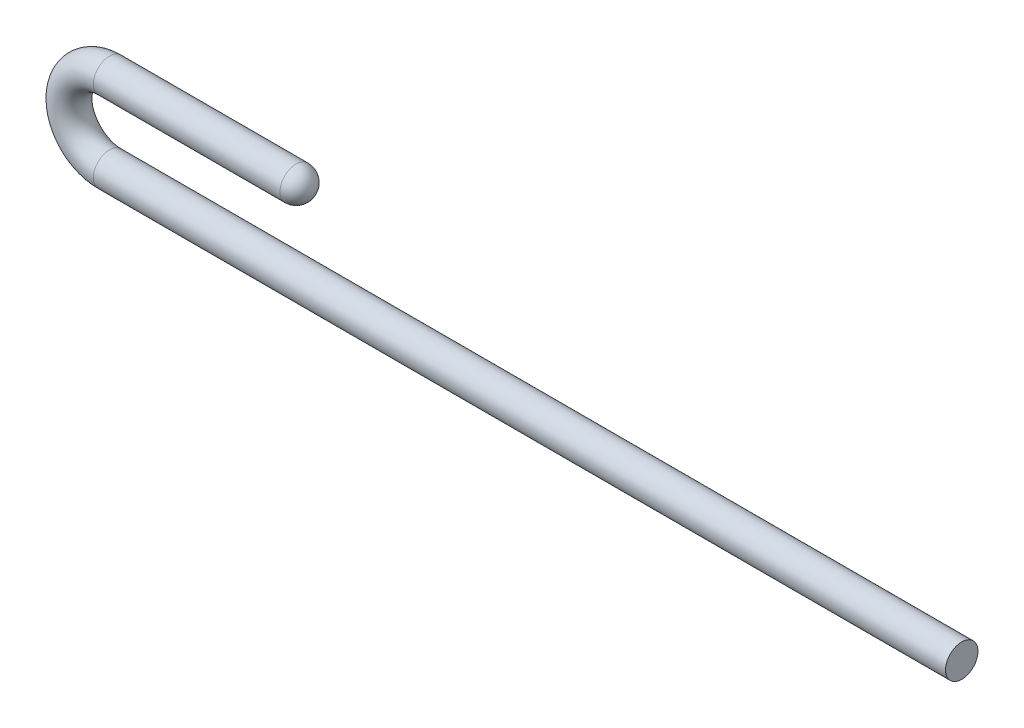
ISO-10303-21;
HEADER;
FILE_DESCRIPTION(('STEP AP214'),'2;1');
FILE_NAME('part.step','',(''),(''),'','','');
FILE_SCHEMA(('AUTOMOTIVE_DESIGN { 1 0 10303 214 1 1 1 1 }'));
ENDSEC;
DATA;
#1=APPLICATION_CONTEXT('core data for automotive mechanical design processes');
#2=APPLICATION_PROTOCOL_DEFINITION('international standard','automotive_design',2000,#1);
#3=PRODUCT_CONTEXT('',#1,'mechanical');
#4=PRODUCT('Part','Part','',(#3));
#5=PRODUCT_RELATED_PRODUCT_CATEGORY('part','',(#4));
#6=PRODUCT_DEFINITION_FORMATION('','',#4);
#7=PRODUCT_DEFINITION_CONTEXT('part definition',#1,'design');
#8=PRODUCT_DEFINITION('design','',#6,#7);
#9=PRODUCT_DEFINITION_SHAPE('','',#8);
#10=(LENGTH_UNIT() NAMED_UNIT(*) SI_UNIT(.MILLI.,.METRE.));
#11=(NAMED_UNIT(*) PLANE_ANGLE_UNIT() SI_UNIT($,.RADIAN.));
#12=(NAMED_UNIT(*) SI_UNIT($,.STERADIAN.) SOLID_ANGLE_UNIT());
#13=UNCERTAINTY_MEASURE_WITH_UNIT(LENGTH_MEASURE(1.E-05),#10,'distance_accuracy_value','');
#14=(GEOMETRIC_REPRESENTATION_CONTEXT(3) GLOBAL_UNCERTAINTY_ASSIGNED_CONTEXT((#13)) GLOBAL_UNIT_ASSIGNED_CONTEXT((#10,
#11,#12)) REPRESENTATION_CONTEXT('',''));
#15=CARTESIAN_POINT('',(0.,0.,0.));
#16=DIRECTION('',(0.,0.,1.));
#17=DIRECTION('',(1.,0.,0.));
#18=AXIS2_PLACEMENT_3D('',#15,#16,#17);
#19=CARTESIAN_POINT('',(-21.,2.,0.));
#20=DIRECTION('',(1.,0.,0.));
#21=DIRECTION('',(0.,1.,0.));
#22=AXIS2_PLACEMENT_3D('',#19,#20,#21);
#23=CYLINDRICAL_SURFACE('',#22,0.4);
#24=CARTESIAN_POINT('',(-16.4,2.,0.));
#25=DIRECTION('',(1.,0.,0.));
#26=DIRECTION('',(0.,1.,0.));
#27=AXIS2_PLACEMENT_3D('',#24,#25,#26);
#28=CIRCLE('',#27,0.4);
#29=CARTESIAN_POINT('',(-16.4,2.4,0.));
#30=VERTEX_POINT('',#29);
#31=EDGE_CURVE('E10',#30,#30,#28,.F.);
#32=ORIENTED_EDGE('',*,*,#31,.T.);
#33=EDGE_LOOP('',(#32));
#34=FACE_BOUND('',#33,.T.);
#35=CARTESIAN_POINT('',(-21.,2.,0.));
#36=DIRECTION('',(-1.,0.,0.));
#37=DIRECTION('',(0.,0.,-1.));
#38=AXIS2_PLACEMENT_3D('',#35,#36,#37);
#39=CIRCLE('',#38,0.4);
#40=CARTESIAN_POINT('',(-21.,2.4,0.));
#41=VERTEX_POINT('',#40);
#42=EDGE_CURVE('E35',#41,#41,#39,.T.);
#43=ORIENTED_EDGE('',*,*,#42,.F.);
#44=EDGE_LOOP('',(#43));
#45=FACE_BOUND('',#44,.T.);
#46=ADVANCED_FACE('F29',(#34,#45),#23,.T.);
#47=CARTESIAN_POINT('',(-21.,0.999999999999997,0.));
#48=DIRECTION('',(0.,0.,-1.));
#49=DIRECTION('',(-1.,0.,0.));
#50=AXIS2_PLACEMENT_3D('',#47,#48,#49);
#51=TOROIDAL_SURFACE('',#50,1.,0.4);
#52=CARTESIAN_POINT('',(-21.,0.,0.));
#53=DIRECTION('',(1.,0.,0.));
#54=DIRECTION('',(0.,0.,-1.));
#55=AXIS2_PLACEMENT_3D('',#52,#53,#54);
#56=CIRCLE('',#55,0.4);
#57=CARTESIAN_POINT('',(-21.,-0.400000000000003,0.));
#58=VERTEX_POINT('',#57);
#59=EDGE_CURVE('E39',#58,#58,#56,.T.);
#60=CARTESIAN_POINT('',(-21.,0.999999999999997,0.));
#61=DIRECTION('',(0.,0.,-1.));
#62=DIRECTION('',(-1.,0.,0.));
#63=AXIS2_PLACEMENT_3D('',#60,#61,#62);
#64=CIRCLE('',#63,1.4);
#65=EDGE_CURVE('',#58,#41,#64,.T.);
#66=ORIENTED_EDGE('',*,*,#59,.F.);
#67=ORIENTED_EDGE('',*,*,#42,.T.);
#68=ORIENTED_EDGE('',*,*,#65,.T.);
#69=ORIENTED_EDGE('',*,*,#65,.F.);
#70=EDGE_LOOP('',(#66,#68,#67,#69));
#71=FACE_BOUND('',#70,.T.);
#72=ADVANCED_FACE('F53',(#71),#51,.T.);
#73=CARTESIAN_POINT('',(-21.,0.,0.));
#74=DIRECTION('',(1.,0.,0.));
#75=DIRECTION('',(0.,1.,0.));
#76=AXIS2_PLACEMENT_3D('',#73,#74,#75);
#77=CYLINDRICAL_SURFACE('',#76,0.4);
#78=ORIENTED_EDGE('',*,*,#59,.T.);
#79=EDGE_LOOP('',(#78));
#80=FACE_BOUND('',#79,.T.);
#81=CARTESIAN_POINT('',(0.,0.,0.));
#82=DIRECTION('',(1.,0.,0.));
#83=DIRECTION('',(0.,0.,-1.));
#84=AXIS2_PLACEMENT_3D('',#81,#82,#83);
#85=CIRCLE('',#84,0.4);
#86=CARTESIAN_POINT('',(0.,0.,-0.4));
#87=VERTEX_POINT('',#86);
#88=EDGE_CURVE('E43',#87,#87,#85,.T.);
#89=ORIENTED_EDGE('',*,*,#88,.F.);
#90=EDGE_LOOP('',(#89));
#91=FACE_BOUND('',#90,.T.);
#92=ADVANCED_FACE('F51',(#80,#91),#77,.T.);
#93=CARTESIAN_POINT('',(0.,0.,0.));
#94=DIRECTION('',(1.,0.,0.));
#95=DIRECTION('',(0.,0.,-1.));
#96=AXIS2_PLACEMENT_3D('',#93,#94,#95);
#97=PLANE('',#96);
#98=ORIENTED_EDGE('',*,*,#88,.T.);
#99=EDGE_LOOP('',(#98));
#100=FACE_BOUND('',#99,.T.);
#101=ADVANCED_FACE('F49',(#100),#97,.T.);
#102=CARTESIAN_POINT('',(-16.4,2.,0.));
#103=DIRECTION('',(0.,0.,1.));
#104=DIRECTION('',(1.,0.,0.));
#105=AXIS2_PLACEMENT_3D('',#102,#103,#104);
#106=SPHERICAL_SURFACE('',#105,0.4);
#107=CARTESIAN_POINT('',(-16.4,2.,0.));
#108=DIRECTION('',(1.,0.,0.));
#109=DIRECTION('',(0.,1.,0.));
#110=AXIS2_PLACEMENT_3D('',#107,#108,#109);
#111=SPHERICAL_SURFACE('',#110,0.4);
#112=ORIENTED_EDGE('',*,*,#31,.F.);
#113=EDGE_LOOP('',(#112));
#114=FACE_BOUND('',#113,.T.);
#115=ADVANCED_FACE('F60',(#114),#111,.T.);
#116=CLOSED_SHELL('',(#46,#72,#92,#101,#115));
#117=MANIFOLD_SOLID_BREP('B2',#116);
#118=ADVANCED_BREP_SHAPE_REPRESENTATION('',(#18,#117),#14);
#119=SHAPE_DEFINITION_REPRESENTATION(#9,#118);
ENDSEC;
END-ISO-10303-21;
